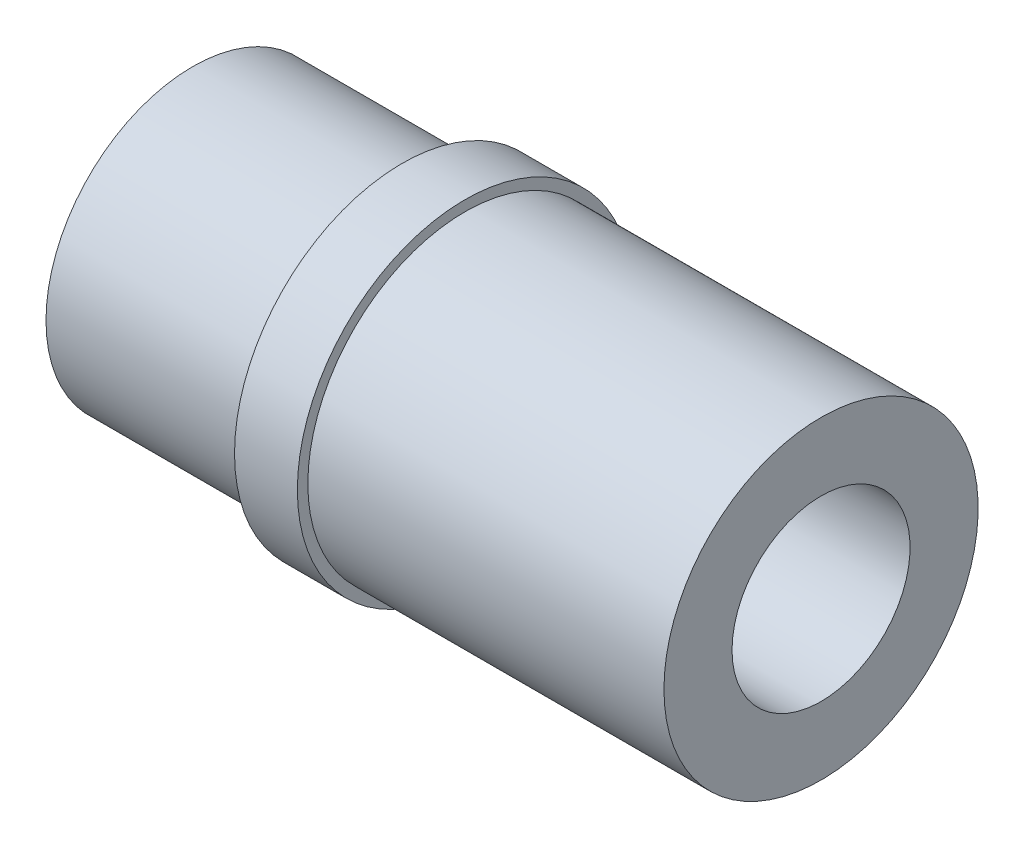
ISO-10303-21;
HEADER;
FILE_DESCRIPTION(('STEP AP214'),'2;1');
FILE_NAME('part.step','',(''),(''),'','','');
FILE_SCHEMA(('AUTOMOTIVE_DESIGN { 1 0 10303 214 1 1 1 1 }'));
ENDSEC;
DATA;
#1=APPLICATION_CONTEXT('core data for automotive mechanical design processes');
#2=APPLICATION_PROTOCOL_DEFINITION('international standard','automotive_design',2000,#1);
#3=PRODUCT_CONTEXT('',#1,'mechanical');
#4=PRODUCT('Part','Part','',(#3));
#5=PRODUCT_RELATED_PRODUCT_CATEGORY('part','',(#4));
#6=PRODUCT_DEFINITION_FORMATION('','',#4);
#7=PRODUCT_DEFINITION_CONTEXT('part definition',#1,'design');
#8=PRODUCT_DEFINITION('design','',#6,#7);
#9=PRODUCT_DEFINITION_SHAPE('','',#8);
#10=(LENGTH_UNIT() NAMED_UNIT(*) SI_UNIT(.MILLI.,.METRE.));
#11=(NAMED_UNIT(*) PLANE_ANGLE_UNIT() SI_UNIT($,.RADIAN.));
#12=(NAMED_UNIT(*) SI_UNIT($,.STERADIAN.) SOLID_ANGLE_UNIT());
#13=UNCERTAINTY_MEASURE_WITH_UNIT(LENGTH_MEASURE(1.E-05),#10,'distance_accuracy_value','');
#14=(GEOMETRIC_REPRESENTATION_CONTEXT(3) GLOBAL_UNCERTAINTY_ASSIGNED_CONTEXT((#13)) GLOBAL_UNIT_ASSIGNED_CONTEXT((#10,
#11,#12)) REPRESENTATION_CONTEXT('',''));
#15=CARTESIAN_POINT('',(0.,0.,0.));
#16=DIRECTION('',(0.,0.,1.));
#17=DIRECTION('',(1.,0.,0.));
#18=AXIS2_PLACEMENT_3D('',#15,#16,#17);
#19=CARTESIAN_POINT('',(0.,0.,0.));
#20=DIRECTION('',(-1.,0.,0.));
#21=DIRECTION('',(0.,0.,1.));
#22=AXIS2_PLACEMENT_3D('',#19,#20,#21);
#23=CONICAL_SURFACE('',#22,5.5,0.139800873084746);
#24=CARTESIAN_POINT('',(8.88296253496849,0.,0.));
#25=DIRECTION('',(-1.,0.,0.));
#26=DIRECTION('',(0.,0.,1.));
#27=AXIS2_PLACEMENT_3D('',#24,#25,#26);
#28=CIRCLE('',#27,4.25);
#29=CARTESIAN_POINT('',(8.88296253496849,0.,4.25));
#30=VERTEX_POINT('',#29);
#31=EDGE_CURVE('E66',#30,#30,#28,.T.);
#32=ORIENTED_EDGE('',*,*,#31,.F.);
#33=EDGE_LOOP('',(#32));
#34=FACE_BOUND('',#33,.T.);
#35=CARTESIAN_POINT('',(0.,0.,0.));
#36=DIRECTION('',(-1.,0.,0.));
#37=DIRECTION('',(0.,0.,1.));
#38=AXIS2_PLACEMENT_3D('',#35,#36,#37);
#39=CIRCLE('',#38,5.5);
#40=CARTESIAN_POINT('',(0.,0.,5.5));
#41=VERTEX_POINT('',#40);
#42=EDGE_CURVE('E10',#41,#41,#39,.T.);
#43=ORIENTED_EDGE('',*,*,#42,.T.);
#44=EDGE_LOOP('',(#43));
#45=FACE_BOUND('',#44,.T.);
#46=ADVANCED_FACE('F35',(#34,#45),#23,.F.);
#47=CARTESIAN_POINT('',(0.,5.5,0.));
#48=DIRECTION('',(1.,0.,0.));
#49=DIRECTION('',(0.,0.,-1.));
#50=AXIS2_PLACEMENT_3D('',#47,#48,#49);
#51=PLANE('',#50);
#52=ORIENTED_EDGE('',*,*,#42,.F.);
#53=EDGE_LOOP('',(#52));
#54=FACE_BOUND('',#53,.T.);
#55=CARTESIAN_POINT('',(0.,0.,0.));
#56=DIRECTION('',(-1.,0.,0.));
#57=DIRECTION('',(0.,0.,1.));
#58=AXIS2_PLACEMENT_3D('',#55,#56,#57);
#59=CIRCLE('',#58,7.);
#60=CARTESIAN_POINT('',(0.,0.,7.));
#61=VERTEX_POINT('',#60);
#62=EDGE_CURVE('E41',#61,#61,#59,.T.);
#63=ORIENTED_EDGE('',*,*,#62,.T.);
#64=EDGE_LOOP('',(#63));
#65=FACE_BOUND('',#64,.T.);
#66=ADVANCED_FACE('F73',(#54,#65),#51,.F.);
#67=CARTESIAN_POINT('',(0.,0.,0.));
#68=DIRECTION('',(-1.,0.,0.));
#69=DIRECTION('',(0.,0.,1.));
#70=AXIS2_PLACEMENT_3D('',#67,#68,#69);
#71=CYLINDRICAL_SURFACE('',#70,7.);
#72=ORIENTED_EDGE('',*,*,#62,.F.);
#73=EDGE_LOOP('',(#72));
#74=FACE_BOUND('',#73,.T.);
#75=CARTESIAN_POINT('',(10.,0.,0.));
#76=DIRECTION('',(-1.,0.,0.));
#77=DIRECTION('',(0.,0.,1.));
#78=AXIS2_PLACEMENT_3D('',#75,#76,#77);
#79=CIRCLE('',#78,7.);
#80=CARTESIAN_POINT('',(10.,0.,7.));
#81=VERTEX_POINT('',#80);
#82=EDGE_CURVE('E45',#81,#81,#79,.T.);
#83=ORIENTED_EDGE('',*,*,#82,.T.);
#84=EDGE_LOOP('',(#83));
#85=FACE_BOUND('',#84,.T.);
#86=ADVANCED_FACE('F77',(#74,#85),#71,.T.);
#87=CARTESIAN_POINT('',(10.,7.,0.));
#88=DIRECTION('',(1.,0.,0.));
#89=DIRECTION('',(0.,0.,-1.));
#90=AXIS2_PLACEMENT_3D('',#87,#88,#89);
#91=PLANE('',#90);
#92=ORIENTED_EDGE('',*,*,#82,.F.);
#93=EDGE_LOOP('',(#92));
#94=FACE_BOUND('',#93,.T.);
#95=CARTESIAN_POINT('',(10.,0.,0.));
#96=DIRECTION('',(-1.,0.,0.));
#97=DIRECTION('',(0.,0.,1.));
#98=AXIS2_PLACEMENT_3D('',#95,#96,#97);
#99=CIRCLE('',#98,8.);
#100=CARTESIAN_POINT('',(10.,0.,8.));
#101=VERTEX_POINT('',#100);
#102=EDGE_CURVE('E49',#101,#101,#99,.T.);
#103=ORIENTED_EDGE('',*,*,#102,.T.);
#104=EDGE_LOOP('',(#103));
#105=FACE_BOUND('',#104,.T.);
#106=ADVANCED_FACE('F82',(#94,#105),#91,.F.);
#107=CARTESIAN_POINT('',(0.,0.,0.));
#108=DIRECTION('',(-1.,0.,0.));
#109=DIRECTION('',(0.,0.,1.));
#110=AXIS2_PLACEMENT_3D('',#107,#108,#109);
#111=CYLINDRICAL_SURFACE('',#110,8.);
#112=ORIENTED_EDGE('',*,*,#102,.F.);
#113=EDGE_LOOP('',(#112));
#114=FACE_BOUND('',#113,.T.);
#115=CARTESIAN_POINT('',(13.,0.,0.));
#116=DIRECTION('',(-1.,0.,0.));
#117=DIRECTION('',(0.,0.,1.));
#118=AXIS2_PLACEMENT_3D('',#115,#116,#117);
#119=CIRCLE('',#118,8.);
#120=CARTESIAN_POINT('',(13.,0.,8.));
#121=VERTEX_POINT('',#120);
#122=EDGE_CURVE('E54',#121,#121,#119,.T.);
#123=ORIENTED_EDGE('',*,*,#122,.T.);
#124=EDGE_LOOP('',(#123));
#125=FACE_BOUND('',#124,.T.);
#126=ADVANCED_FACE('F88',(#114,#125),#111,.T.);
#127=CARTESIAN_POINT('',(13.,8.,0.));
#128=DIRECTION('',(-1.,0.,0.));
#129=DIRECTION('',(0.,0.,1.));
#130=AXIS2_PLACEMENT_3D('',#127,#128,#129);
#131=PLANE('',#130);
#132=ORIENTED_EDGE('',*,*,#122,.F.);
#133=EDGE_LOOP('',(#132));
#134=FACE_BOUND('',#133,.T.);
#135=CARTESIAN_POINT('',(13.,0.,0.));
#136=DIRECTION('',(-1.,0.,0.));
#137=DIRECTION('',(0.,0.,1.));
#138=AXIS2_PLACEMENT_3D('',#135,#136,#137);
#139=CIRCLE('',#138,7.5);
#140=CARTESIAN_POINT('',(13.,0.,7.5));
#141=VERTEX_POINT('',#140);
#142=EDGE_CURVE('E57',#141,#141,#139,.T.);
#143=ORIENTED_EDGE('',*,*,#142,.T.);
#144=EDGE_LOOP('',(#143));
#145=FACE_BOUND('',#144,.T.);
#146=ADVANCED_FACE('F92',(#134,#145),#131,.F.);
#147=CARTESIAN_POINT('',(0.,0.,0.));
#148=DIRECTION('',(-1.,0.,0.));
#149=DIRECTION('',(0.,0.,1.));
#150=AXIS2_PLACEMENT_3D('',#147,#148,#149);
#151=CYLINDRICAL_SURFACE('',#150,7.5);
#152=ORIENTED_EDGE('',*,*,#142,.F.);
#153=EDGE_LOOP('',(#152));
#154=FACE_BOUND('',#153,.T.);
#155=CARTESIAN_POINT('',(30.,0.,0.));
#156=DIRECTION('',(-1.,0.,0.));
#157=DIRECTION('',(0.,0.,1.));
#158=AXIS2_PLACEMENT_3D('',#155,#156,#157);
#159=CIRCLE('',#158,7.5);
#160=CARTESIAN_POINT('',(30.,0.,7.5));
#161=VERTEX_POINT('',#160);
#162=EDGE_CURVE('E60',#161,#161,#159,.T.);
#163=ORIENTED_EDGE('',*,*,#162,.T.);
#164=EDGE_LOOP('',(#163));
#165=FACE_BOUND('',#164,.T.);
#166=ADVANCED_FACE('F96',(#154,#165),#151,.T.);
#167=CARTESIAN_POINT('',(30.,7.5,0.));
#168=DIRECTION('',(-1.,0.,0.));
#169=DIRECTION('',(0.,0.,1.));
#170=AXIS2_PLACEMENT_3D('',#167,#168,#169);
#171=PLANE('',#170);
#172=ORIENTED_EDGE('',*,*,#162,.F.);
#173=EDGE_LOOP('',(#172));
#174=FACE_BOUND('',#173,.T.);
#175=CARTESIAN_POINT('',(30.,0.,0.));
#176=DIRECTION('',(-1.,0.,0.));
#177=DIRECTION('',(0.,0.,1.));
#178=AXIS2_PLACEMENT_3D('',#175,#176,#177);
#179=CIRCLE('',#178,4.25);
#180=CARTESIAN_POINT('',(30.,0.,4.25));
#181=VERTEX_POINT('',#180);
#182=EDGE_CURVE('E63',#181,#181,#179,.T.);
#183=ORIENTED_EDGE('',*,*,#182,.T.);
#184=EDGE_LOOP('',(#183));
#185=FACE_BOUND('',#184,.T.);
#186=ADVANCED_FACE('F100',(#174,#185),#171,.F.);
#187=CARTESIAN_POINT('',(0.,0.,0.));
#188=DIRECTION('',(-1.,0.,0.));
#189=DIRECTION('',(0.,0.,1.));
#190=AXIS2_PLACEMENT_3D('',#187,#188,#189);
#191=CYLINDRICAL_SURFACE('',#190,4.25);
#192=ORIENTED_EDGE('',*,*,#182,.F.);
#193=EDGE_LOOP('',(#192));
#194=FACE_BOUND('',#193,.T.);
#195=ORIENTED_EDGE('',*,*,#31,.T.);
#196=EDGE_LOOP('',(#195));
#197=FACE_BOUND('',#196,.T.);
#198=ADVANCED_FACE('F70',(#194,#197),#191,.F.);
#199=CLOSED_SHELL('',(#46,#66,#86,#106,#126,#146,#166,#186,#198));
#200=MANIFOLD_SOLID_BREP('B2',#199);
#201=ADVANCED_BREP_SHAPE_REPRESENTATION('',(#18,#200),#14);
#202=SHAPE_DEFINITION_REPRESENTATION(#9,#201);
ENDSEC;
END-ISO-10303-21;
